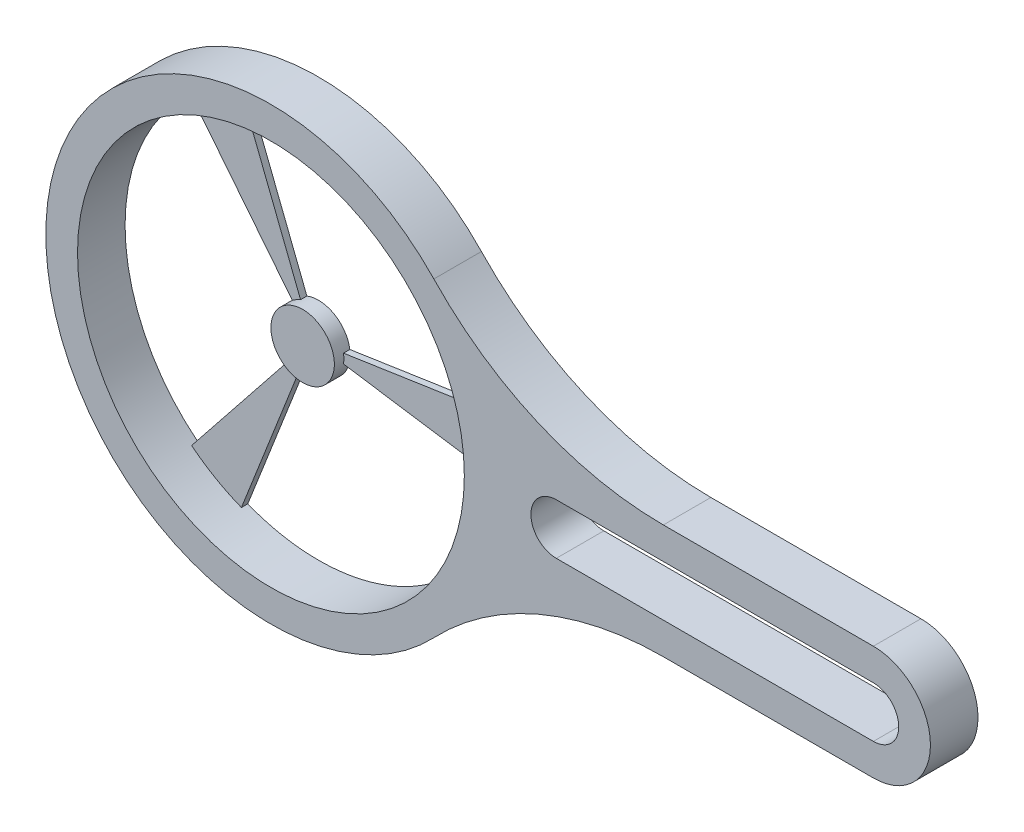
ISO-10303-21;
HEADER;
FILE_DESCRIPTION(('STEP AP214'),'2;1');
FILE_NAME('part.step','',(''),(''),'','','');
FILE_SCHEMA(('AUTOMOTIVE_DESIGN { 1 0 10303 214 1 1 1 1 }'));
ENDSEC;
DATA;
#1=APPLICATION_CONTEXT('core data for automotive mechanical design processes');
#2=APPLICATION_PROTOCOL_DEFINITION('international standard','automotive_design',2000,#1);
#3=PRODUCT_CONTEXT('',#1,'mechanical');
#4=PRODUCT('Part','Part','',(#3));
#5=PRODUCT_RELATED_PRODUCT_CATEGORY('part','',(#4));
#6=PRODUCT_DEFINITION_FORMATION('','',#4);
#7=PRODUCT_DEFINITION_CONTEXT('part definition',#1,'design');
#8=PRODUCT_DEFINITION('design','',#6,#7);
#9=PRODUCT_DEFINITION_SHAPE('','',#8);
#10=(LENGTH_UNIT() NAMED_UNIT(*) SI_UNIT(.MILLI.,.METRE.));
#11=(NAMED_UNIT(*) PLANE_ANGLE_UNIT() SI_UNIT($,.RADIAN.));
#12=(NAMED_UNIT(*) SI_UNIT($,.STERADIAN.) SOLID_ANGLE_UNIT());
#13=UNCERTAINTY_MEASURE_WITH_UNIT(LENGTH_MEASURE(1.E-05),#10,'distance_accuracy_value','');
#14=(GEOMETRIC_REPRESENTATION_CONTEXT(3) GLOBAL_UNCERTAINTY_ASSIGNED_CONTEXT((#13)) GLOBAL_UNIT_ASSIGNED_CONTEXT((#10,
#11,#12)) REPRESENTATION_CONTEXT('',''));
#15=CARTESIAN_POINT('',(0.,0.,0.));
#16=DIRECTION('',(0.,0.,1.));
#17=DIRECTION('',(1.,0.,0.));
#18=AXIS2_PLACEMENT_3D('',#15,#16,#17);
#19=CARTESIAN_POINT('',(0.,0.,15.));
#20=DIRECTION('',(0.,0.,-1.));
#21=DIRECTION('',(-1.,0.,0.));
#22=AXIS2_PLACEMENT_3D('',#19,#20,#21);
#23=CYLINDRICAL_SURFACE('',#22,61.);
#24=CARTESIAN_POINT('',(0.,0.,15.));
#25=DIRECTION('',(0.,0.,1.));
#26=DIRECTION('',(1.,0.,0.));
#27=AXIS2_PLACEMENT_3D('',#24,#25,#26);
#28=CIRCLE('',#27,61.);
#29=CARTESIAN_POINT('',(61.,0.,15.));
#30=VERTEX_POINT('',#29);
#31=EDGE_CURVE('E340',#30,#30,#28,.T.);
#32=ORIENTED_EDGE('',*,*,#31,.T.);
#33=EDGE_LOOP('',(#32));
#34=FACE_BOUND('',#33,.T.);
#35=CARTESIAN_POINT('',(0.,0.,2.));
#36=DIRECTION('',(0.,0.,-1.));
#37=DIRECTION('',(-1.,0.,0.));
#38=AXIS2_PLACEMENT_3D('',#35,#36,#37);
#39=CIRCLE('',#38,61.);
#40=CARTESIAN_POINT('',(-30.5007499967145,-52.8271166129472,2.));
#41=VERTEX_POINT('',#40);
#42=CARTESIAN_POINT('',(-38.0202984913741,-47.7017494713435,2.));
#43=VERTEX_POINT('',#42);
#44=EDGE_CURVE('E224',#41,#43,#39,.T.);
#45=ORIENTED_EDGE('',*,*,#44,.T.);
#46=DIRECTION('',(0.,0.,-1.));
#47=VECTOR('',#46,1.);
#48=CARTESIAN_POINT('',(-38.0202984913741,-47.7017494713435,2.));
#49=LINE('',#48,#47);
#50=CARTESIAN_POINT('',(-38.0202984913741,-47.7017494713435,0.));
#51=VERTEX_POINT('',#50);
#52=EDGE_CURVE('E243',#43,#51,#49,.T.);
#53=ORIENTED_EDGE('',*,*,#52,.T.);
#54=CARTESIAN_POINT('',(0.,0.,0.));
#55=DIRECTION('',(0.,0.,1.));
#56=DIRECTION('',(1.,0.,0.));
#57=AXIS2_PLACEMENT_3D('',#54,#55,#56);
#58=CIRCLE('',#57,61.);
#59=CARTESIAN_POINT('',(-38.0202984913748,47.7017494713429,0.));
#60=VERTEX_POINT('',#59);
#61=EDGE_CURVE('E371',#60,#51,#58,.T.);
#62=ORIENTED_EDGE('',*,*,#61,.F.);
#63=DIRECTION('',(0.,0.,-1.));
#64=VECTOR('',#63,1.);
#65=CARTESIAN_POINT('',(-38.0202984913748,47.7017494713429,2.));
#66=LINE('',#65,#64);
#67=CARTESIAN_POINT('',(-38.0202984913748,47.7017494713429,2.));
#68=VERTEX_POINT('',#67);
#69=EDGE_CURVE('E314',#68,#60,#66,.T.);
#70=ORIENTED_EDGE('',*,*,#69,.F.);
#71=CARTESIAN_POINT('',(0.,0.,2.));
#72=DIRECTION('',(0.,0.,-1.));
#73=DIRECTION('',(-1.,0.,0.));
#74=AXIS2_PLACEMENT_3D('',#71,#72,#73);
#75=CIRCLE('',#74,61.);
#76=CARTESIAN_POINT('',(-30.5007499969265,52.8271166128248,2.));
#77=VERTEX_POINT('',#76);
#78=EDGE_CURVE('E292',#68,#77,#75,.T.);
#79=ORIENTED_EDGE('',*,*,#78,.T.);
#80=DIRECTION('',(0.,0.,-1.));
#81=VECTOR('',#80,1.);
#82=CARTESIAN_POINT('',(-30.5007499969265,52.8271166128248,2.));
#83=LINE('',#82,#81);
#84=CARTESIAN_POINT('',(-30.5007499969265,52.8271166128248,0.));
#85=VERTEX_POINT('',#84);
#86=EDGE_CURVE('E307',#77,#85,#83,.T.);
#87=ORIENTED_EDGE('',*,*,#86,.T.);
#88=CARTESIAN_POINT('',(-30.5007499967145,-52.8271166129472,0.));
#89=VERTEX_POINT('',#88);
#90=EDGE_CURVE('E370',#89,#85,#58,.T.);
#91=ORIENTED_EDGE('',*,*,#90,.F.);
#92=DIRECTION('',(0.,0.,-1.));
#93=VECTOR('',#92,1.);
#94=CARTESIAN_POINT('',(-30.5007499967145,-52.8271166129472,2.));
#95=LINE('',#94,#93);
#96=EDGE_CURVE('E215',#41,#89,#95,.T.);
#97=ORIENTED_EDGE('',*,*,#96,.F.);
#98=EDGE_LOOP('',(#45,#53,#62,#70,#79,#87,#91,#97));
#99=FACE_BOUND('',#98,.T.);
#100=ADVANCED_FACE('F39',(#34,#99),#23,.F.);
#101=CARTESIAN_POINT('',(0.,0.,5.));
#102=DIRECTION('',(0.,0.,-1.));
#103=DIRECTION('',(-1.,0.,0.));
#104=AXIS2_PLACEMENT_3D('',#101,#102,#103);
#105=CYLINDRICAL_SURFACE('',#104,10.);
#106=DIRECTION('',(0.,0.,-1.));
#107=VECTOR('',#106,1.);
#108=CARTESIAN_POINT('',(-3.65696659329943,-9.30734093796354,2.));
#109=LINE('',#108,#107);
#110=CARTESIAN_POINT('',(-3.65696659329943,-9.30734093796354,2.));
#111=VERTEX_POINT('',#110);
#112=CARTESIAN_POINT('',(-3.65696659329943,-9.30734093796354,0.));
#113=VERTEX_POINT('',#112);
#114=EDGE_CURVE('E228',#111,#113,#109,.T.);
#115=ORIENTED_EDGE('',*,*,#114,.T.);
#116=CARTESIAN_POINT('',(0.,0.,0.));
#117=DIRECTION('',(0.,0.,-1.));
#118=DIRECTION('',(-1.,0.,0.));
#119=AXIS2_PLACEMENT_3D('',#116,#117,#118);
#120=CIRCLE('',#119,10.);
#121=CARTESIAN_POINT('',(9.88871644305629,-1.48771203827495,0.));
#122=VERTEX_POINT('',#121);
#123=EDGE_CURVE('E291',#122,#113,#120,.T.);
#124=ORIENTED_EDGE('',*,*,#123,.F.);
#125=DIRECTION('',(0.,0.,-1.));
#126=VECTOR('',#125,1.);
#127=CARTESIAN_POINT('',(9.88871644305629,-1.48771203827495,2.));
#128=LINE('',#127,#126);
#129=CARTESIAN_POINT('',(9.88871644305629,-1.48771203827495,2.));
#130=VERTEX_POINT('',#129);
#131=EDGE_CURVE('E273',#130,#122,#128,.T.);
#132=ORIENTED_EDGE('',*,*,#131,.F.);
#133=CARTESIAN_POINT('',(0.,0.,2.));
#134=DIRECTION('',(0.,0.,-1.));
#135=DIRECTION('',(-1.,0.,0.));
#136=AXIS2_PLACEMENT_3D('',#133,#134,#135);
#137=CIRCLE('',#136,10.);
#138=CARTESIAN_POINT('',(9.88871644305629,1.48771203827495,2.));
#139=VERTEX_POINT('',#138);
#140=EDGE_CURVE('E247',#139,#130,#137,.T.);
#141=ORIENTED_EDGE('',*,*,#140,.F.);
#142=DIRECTION('',(0.,0.,-1.));
#143=VECTOR('',#142,1.);
#144=CARTESIAN_POINT('',(9.88871644305629,1.48771203827495,2.));
#145=LINE('',#144,#143);
#146=CARTESIAN_POINT('',(9.88871644305629,1.48771203827495,0.));
#147=VERTEX_POINT('',#146);
#148=EDGE_CURVE('E262',#139,#147,#145,.T.);
#149=ORIENTED_EDGE('',*,*,#148,.T.);
#150=CARTESIAN_POINT('',(-3.65696659329956,9.30734093796349,0.));
#151=VERTEX_POINT('',#150);
#152=EDGE_CURVE('E288',#151,#147,#120,.T.);
#153=ORIENTED_EDGE('',*,*,#152,.F.);
#154=DIRECTION('',(0.,0.,-1.));
#155=VECTOR('',#154,1.);
#156=CARTESIAN_POINT('',(-3.65696659329956,9.30734093796349,2.));
#157=LINE('',#156,#155);
#158=CARTESIAN_POINT('',(-3.65696659329956,9.30734093796349,2.));
#159=VERTEX_POINT('',#158);
#160=EDGE_CURVE('E321',#159,#151,#157,.T.);
#161=ORIENTED_EDGE('',*,*,#160,.F.);
#162=CARTESIAN_POINT('',(0.,0.,2.));
#163=DIRECTION('',(0.,0.,-1.));
#164=DIRECTION('',(-1.,0.,0.));
#165=AXIS2_PLACEMENT_3D('',#162,#163,#164);
#166=CIRCLE('',#165,10.);
#167=CARTESIAN_POINT('',(-6.23324981595711,7.81962893824705,2.));
#168=VERTEX_POINT('',#167);
#169=EDGE_CURVE('E301',#168,#159,#166,.T.);
#170=ORIENTED_EDGE('',*,*,#169,.F.);
#171=DIRECTION('',(0.,0.,-1.));
#172=VECTOR('',#171,1.);
#173=CARTESIAN_POINT('',(-6.23324981595711,7.81962893824705,2.));
#174=LINE('',#173,#172);
#175=CARTESIAN_POINT('',(-6.23324981595711,7.81962893824705,0.));
#176=VERTEX_POINT('',#175);
#177=EDGE_CURVE('E318',#168,#176,#174,.T.);
#178=ORIENTED_EDGE('',*,*,#177,.T.);
#179=CARTESIAN_POINT('',(-6.233249815957,-7.81962893824714,0.));
#180=VERTEX_POINT('',#179);
#181=EDGE_CURVE('E275',#180,#176,#120,.T.);
#182=ORIENTED_EDGE('',*,*,#181,.F.);
#183=DIRECTION('',(0.,0.,-1.));
#184=VECTOR('',#183,1.);
#185=CARTESIAN_POINT('',(-6.233249815957,-7.81962893824714,2.));
#186=LINE('',#185,#184);
#187=CARTESIAN_POINT('',(-6.233249815957,-7.81962893824714,2.));
#188=VERTEX_POINT('',#187);
#189=EDGE_CURVE('E241',#188,#180,#186,.T.);
#190=ORIENTED_EDGE('',*,*,#189,.F.);
#191=CARTESIAN_POINT('',(0.,0.,2.));
#192=DIRECTION('',(0.,0.,-1.));
#193=DIRECTION('',(-1.,0.,0.));
#194=AXIS2_PLACEMENT_3D('',#191,#192,#193);
#195=CIRCLE('',#194,10.);
#196=EDGE_CURVE('E216',#111,#188,#195,.T.);
#197=ORIENTED_EDGE('',*,*,#196,.F.);
#198=EDGE_LOOP('',(#115,#124,#132,#141,#149,#153,#161,#170,#178,#182,#190,#197));
#199=FACE_BOUND('',#198,.T.);
#200=CARTESIAN_POINT('',(0.,0.,5.));
#201=DIRECTION('',(0.,0.,-1.));
#202=DIRECTION('',(-1.,0.,0.));
#203=AXIS2_PLACEMENT_3D('',#200,#201,#202);
#204=CIRCLE('',#203,10.);
#205=CARTESIAN_POINT('',(-10.,0.,5.));
#206=VERTEX_POINT('',#205);
#207=EDGE_CURVE('E284',#206,#206,#204,.T.);
#208=ORIENTED_EDGE('',*,*,#207,.T.);
#209=EDGE_LOOP('',(#208));
#210=FACE_BOUND('',#209,.T.);
#211=ADVANCED_FACE('F463',(#199,#210),#105,.T.);
#212=CARTESIAN_POINT('',(0.,18.,15.));
#213=DIRECTION('',(0.,-1.,0.));
#214=DIRECTION('',(0.,0.,-1.));
#215=AXIS2_PLACEMENT_3D('',#212,#213,#214);
#216=PLANE('',#215);
#217=DIRECTION('',(-1.,0.,0.));
#218=VECTOR('',#217,1.);
#219=CARTESIAN_POINT('',(0.,18.,0.));
#220=LINE('',#219,#218);
#221=CARTESIAN_POINT('',(190.,18.,0.));
#222=VERTEX_POINT('',#221);
#223=CARTESIAN_POINT('',(123.761868117769,18.,0.));
#224=VERTEX_POINT('',#223);
#225=EDGE_CURVE('E373',#222,#224,#220,.T.);
#226=ORIENTED_EDGE('',*,*,#225,.T.);
#227=DIRECTION('',(0.,0.,-1.));
#228=VECTOR('',#227,1.);
#229=CARTESIAN_POINT('',(123.761868117769,18.,15.));
#230=LINE('',#229,#228);
#231=CARTESIAN_POINT('',(123.761868117769,18.,15.));
#232=VERTEX_POINT('',#231);
#233=EDGE_CURVE('E11',#232,#224,#230,.T.);
#234=ORIENTED_EDGE('',*,*,#233,.F.);
#235=DIRECTION('',(-1.,0.,0.));
#236=VECTOR('',#235,1.);
#237=CARTESIAN_POINT('',(0.,18.,15.));
#238=LINE('',#237,#236);
#239=CARTESIAN_POINT('',(190.,18.,15.));
#240=VERTEX_POINT('',#239);
#241=EDGE_CURVE('E343',#240,#232,#238,.T.);
#242=ORIENTED_EDGE('',*,*,#241,.F.);
#243=DIRECTION('',(0.,0.,-1.));
#244=VECTOR('',#243,1.);
#245=CARTESIAN_POINT('',(190.,18.,15.));
#246=LINE('',#245,#244);
#247=EDGE_CURVE('E388',#240,#222,#246,.T.);
#248=ORIENTED_EDGE('',*,*,#247,.T.);
#249=EDGE_LOOP('',(#226,#234,#242,#248));
#250=FACE_BOUND('',#249,.T.);
#251=ADVANCED_FACE('F435',(#250),#216,.F.);
#252=CARTESIAN_POINT('',(123.761868117769,118.,15.));
#253=DIRECTION('',(0.,0.,-1.));
#254=DIRECTION('',(-1.,0.,0.));
#255=AXIS2_PLACEMENT_3D('',#252,#253,#254);
#256=CYLINDRICAL_SURFACE('',#255,100.);
#257=CARTESIAN_POINT('',(123.761868117769,118.,0.));
#258=DIRECTION('',(0.,0.,1.));
#259=DIRECTION('',(1.,0.,0.));
#260=AXIS2_PLACEMENT_3D('',#257,#258,#259);
#261=CIRCLE('',#260,100.);
#262=CARTESIAN_POINT('',(51.3865066453894,48.9941520467836,0.));
#263=VERTEX_POINT('',#262);
#264=EDGE_CURVE('E376',#224,#263,#261,.F.);
#265=ORIENTED_EDGE('',*,*,#264,.T.);
#266=DIRECTION('',(0.,0.,-1.));
#267=VECTOR('',#266,1.);
#268=CARTESIAN_POINT('',(51.3865066453894,48.9941520467836,15.));
#269=LINE('',#268,#267);
#270=CARTESIAN_POINT('',(51.3865066453894,48.9941520467836,15.));
#271=VERTEX_POINT('',#270);
#272=EDGE_CURVE('E48',#271,#263,#269,.T.);
#273=ORIENTED_EDGE('',*,*,#272,.F.);
#274=CARTESIAN_POINT('',(123.761868117769,118.,15.));
#275=DIRECTION('',(0.,0.,1.));
#276=DIRECTION('',(1.,0.,0.));
#277=AXIS2_PLACEMENT_3D('',#274,#275,#276);
#278=CIRCLE('',#277,100.);
#279=EDGE_CURVE('E346',#232,#271,#278,.F.);
#280=ORIENTED_EDGE('',*,*,#279,.F.);
#281=ORIENTED_EDGE('',*,*,#233,.T.);
#282=EDGE_LOOP('',(#265,#273,#280,#281));
#283=FACE_BOUND('',#282,.T.);
#284=ADVANCED_FACE('F438',(#283),#256,.F.);
#285=CARTESIAN_POINT('',(0.,0.,15.));
#286=DIRECTION('',(0.,0.,-1.));
#287=DIRECTION('',(-1.,0.,0.));
#288=AXIS2_PLACEMENT_3D('',#285,#286,#287);
#289=CYLINDRICAL_SURFACE('',#288,71.);
#290=CARTESIAN_POINT('',(0.,0.,0.));
#291=DIRECTION('',(0.,0.,1.));
#292=DIRECTION('',(1.,0.,0.));
#293=AXIS2_PLACEMENT_3D('',#290,#291,#292);
#294=CIRCLE('',#293,71.);
#295=CARTESIAN_POINT('',(51.3865066453894,-48.9941520467836,0.));
#296=VERTEX_POINT('',#295);
#297=EDGE_CURVE('E378',#263,#296,#294,.T.);
#298=ORIENTED_EDGE('',*,*,#297,.T.);
#299=DIRECTION('',(0.,0.,-1.));
#300=VECTOR('',#299,1.);
#301=CARTESIAN_POINT('',(51.3865066453894,-48.9941520467836,15.));
#302=LINE('',#301,#300);
#303=CARTESIAN_POINT('',(51.3865066453894,-48.9941520467836,15.));
#304=VERTEX_POINT('',#303);
#305=EDGE_CURVE('E395',#304,#296,#302,.T.);
#306=ORIENTED_EDGE('',*,*,#305,.F.);
#307=CARTESIAN_POINT('',(0.,0.,15.));
#308=DIRECTION('',(0.,0.,1.));
#309=DIRECTION('',(1.,0.,0.));
#310=AXIS2_PLACEMENT_3D('',#307,#308,#309);
#311=CIRCLE('',#310,71.);
#312=EDGE_CURVE('E348',#271,#304,#311,.T.);
#313=ORIENTED_EDGE('',*,*,#312,.F.);
#314=ORIENTED_EDGE('',*,*,#272,.T.);
#315=EDGE_LOOP('',(#298,#306,#313,#314));
#316=FACE_BOUND('',#315,.T.);
#317=ADVANCED_FACE('F443',(#316),#289,.T.);
#318=CARTESIAN_POINT('',(123.761868117769,-118.,15.));
#319=DIRECTION('',(0.,0.,-1.));
#320=DIRECTION('',(-1.,0.,0.));
#321=AXIS2_PLACEMENT_3D('',#318,#319,#320);
#322=CYLINDRICAL_SURFACE('',#321,100.);
#323=CARTESIAN_POINT('',(123.761868117769,-118.,0.));
#324=DIRECTION('',(0.,0.,1.));
#325=DIRECTION('',(1.,0.,0.));
#326=AXIS2_PLACEMENT_3D('',#323,#324,#325);
#327=CIRCLE('',#326,100.);
#328=CARTESIAN_POINT('',(123.761868117769,-18.,0.));
#329=VERTEX_POINT('',#328);
#330=EDGE_CURVE('E381',#329,#296,#327,.T.);
#331=ORIENTED_EDGE('',*,*,#330,.F.);
#332=DIRECTION('',(0.,0.,-1.));
#333=VECTOR('',#332,1.);
#334=CARTESIAN_POINT('',(123.761868117769,-18.,15.));
#335=LINE('',#334,#333);
#336=CARTESIAN_POINT('',(123.761868117769,-18.,15.));
#337=VERTEX_POINT('',#336);
#338=EDGE_CURVE('E393',#337,#329,#335,.T.);
#339=ORIENTED_EDGE('',*,*,#338,.F.);
#340=CARTESIAN_POINT('',(123.761868117769,-118.,15.));
#341=DIRECTION('',(0.,0.,1.));
#342=DIRECTION('',(1.,0.,0.));
#343=AXIS2_PLACEMENT_3D('',#340,#341,#342);
#344=CIRCLE('',#343,100.);
#345=EDGE_CURVE('E350',#337,#304,#344,.T.);
#346=ORIENTED_EDGE('',*,*,#345,.T.);
#347=ORIENTED_EDGE('',*,*,#305,.T.);
#348=EDGE_LOOP('',(#331,#339,#346,#347));
#349=FACE_BOUND('',#348,.T.);
#350=ADVANCED_FACE('F453',(#349),#322,.F.);
#351=CARTESIAN_POINT('',(0.,-18.,15.));
#352=DIRECTION('',(0.,-1.,0.));
#353=DIRECTION('',(0.,0.,-1.));
#354=AXIS2_PLACEMENT_3D('',#351,#352,#353);
#355=PLANE('',#354);
#356=DIRECTION('',(-1.,0.,0.));
#357=VECTOR('',#356,1.);
#358=CARTESIAN_POINT('',(0.,-18.,0.));
#359=LINE('',#358,#357);
#360=CARTESIAN_POINT('',(190.,-18.,0.));
#361=VERTEX_POINT('',#360);
#362=EDGE_CURVE('E384',#361,#329,#359,.T.);
#363=ORIENTED_EDGE('',*,*,#362,.F.);
#364=DIRECTION('',(0.,0.,-1.));
#365=VECTOR('',#364,1.);
#366=CARTESIAN_POINT('',(190.,-18.,15.));
#367=LINE('',#366,#365);
#368=CARTESIAN_POINT('',(190.,-18.,15.));
#369=VERTEX_POINT('',#368);
#370=EDGE_CURVE('E391',#369,#361,#367,.T.);
#371=ORIENTED_EDGE('',*,*,#370,.F.);
#372=DIRECTION('',(-1.,0.,0.));
#373=VECTOR('',#372,1.);
#374=CARTESIAN_POINT('',(0.,-18.,15.));
#375=LINE('',#374,#373);
#376=EDGE_CURVE('E353',#369,#337,#375,.T.);
#377=ORIENTED_EDGE('',*,*,#376,.T.);
#378=ORIENTED_EDGE('',*,*,#338,.T.);
#379=EDGE_LOOP('',(#363,#371,#377,#378));
#380=FACE_BOUND('',#379,.T.);
#381=ADVANCED_FACE('F448',(#380),#355,.T.);
#382=CARTESIAN_POINT('',(0.,-8.00000000000001,15.));
#383=DIRECTION('',(0.,1.,0.));
#384=DIRECTION('',(0.,0.,1.));
#385=AXIS2_PLACEMENT_3D('',#382,#383,#384);
#386=PLANE('',#385);
#387=DIRECTION('',(1.,0.,0.));
#388=VECTOR('',#387,1.);
#389=CARTESIAN_POINT('',(0.,-8.00000000000001,0.));
#390=LINE('',#389,#388);
#391=CARTESIAN_POINT('',(90.,-8.00000000000001,0.));
#392=VERTEX_POINT('',#391);
#393=CARTESIAN_POINT('',(190.,-8.00000000000001,0.));
#394=VERTEX_POINT('',#393);
#395=EDGE_CURVE('E317',#392,#394,#390,.T.);
#396=ORIENTED_EDGE('',*,*,#395,.F.);
#397=DIRECTION('',(0.,0.,-1.));
#398=VECTOR('',#397,1.);
#399=CARTESIAN_POINT('',(90.,-8.00000000000001,15.));
#400=LINE('',#399,#398);
#401=CARTESIAN_POINT('',(90.,-8.00000000000001,15.));
#402=VERTEX_POINT('',#401);
#403=EDGE_CURVE('E43',#402,#392,#400,.T.);
#404=ORIENTED_EDGE('',*,*,#403,.F.);
#405=DIRECTION('',(1.,0.,0.));
#406=VECTOR('',#405,1.);
#407=CARTESIAN_POINT('',(0.,-8.00000000000001,15.));
#408=LINE('',#407,#406);
#409=CARTESIAN_POINT('',(190.,-8.00000000000001,15.));
#410=VERTEX_POINT('',#409);
#411=EDGE_CURVE('E328',#402,#410,#408,.T.);
#412=ORIENTED_EDGE('',*,*,#411,.T.);
#413=DIRECTION('',(0.,0.,-1.));
#414=VECTOR('',#413,1.);
#415=CARTESIAN_POINT('',(190.,-8.00000000000001,15.));
#416=LINE('',#415,#414);
#417=EDGE_CURVE('E358',#410,#394,#416,.T.);
#418=ORIENTED_EDGE('',*,*,#417,.T.);
#419=EDGE_LOOP('',(#396,#404,#412,#418));
#420=FACE_BOUND('',#419,.T.);
#421=ADVANCED_FACE('F41',(#420),#386,.T.);
#422=CARTESIAN_POINT('',(90.,0.,15.));
#423=DIRECTION('',(0.,0.,-1.));
#424=DIRECTION('',(-1.,0.,0.));
#425=AXIS2_PLACEMENT_3D('',#422,#423,#424);
#426=CYLINDRICAL_SURFACE('',#425,8.00000000000001);
#427=CARTESIAN_POINT('',(90.,0.,0.));
#428=DIRECTION('',(0.,0.,1.));
#429=DIRECTION('',(1.,0.,0.));
#430=AXIS2_PLACEMENT_3D('',#427,#428,#429);
#431=CIRCLE('',#430,8.00000000000001);
#432=CARTESIAN_POINT('',(90.,8.00000000000001,0.));
#433=VERTEX_POINT('',#432);
#434=EDGE_CURVE('E361',#433,#392,#431,.T.);
#435=ORIENTED_EDGE('',*,*,#434,.F.);
#436=DIRECTION('',(0.,0.,-1.));
#437=VECTOR('',#436,1.);
#438=CARTESIAN_POINT('',(90.,8.00000000000001,15.));
#439=LINE('',#438,#437);
#440=CARTESIAN_POINT('',(90.,8.00000000000001,15.));
#441=VERTEX_POINT('',#440);
#442=EDGE_CURVE('E401',#441,#433,#439,.T.);
#443=ORIENTED_EDGE('',*,*,#442,.F.);
#444=CARTESIAN_POINT('',(90.,0.,15.));
#445=DIRECTION('',(0.,0.,1.));
#446=DIRECTION('',(1.,0.,0.));
#447=AXIS2_PLACEMENT_3D('',#444,#445,#446);
#448=CIRCLE('',#447,8.00000000000001);
#449=EDGE_CURVE('E331',#441,#402,#448,.T.);
#450=ORIENTED_EDGE('',*,*,#449,.T.);
#451=ORIENTED_EDGE('',*,*,#403,.T.);
#452=EDGE_LOOP('',(#435,#443,#450,#451));
#453=FACE_BOUND('',#452,.T.);
#454=ADVANCED_FACE('F408',(#453),#426,.F.);
#455=CARTESIAN_POINT('',(0.,8.,15.));
#456=DIRECTION('',(0.,1.,0.));
#457=DIRECTION('',(-1.,0.,0.));
#458=AXIS2_PLACEMENT_3D('',#455,#456,#457);
#459=PLANE('',#458);
#460=DIRECTION('',(1.,0.,0.));
#461=VECTOR('',#460,1.);
#462=CARTESIAN_POINT('',(0.,8.,0.));
#463=LINE('',#462,#461);
#464=CARTESIAN_POINT('',(190.,8.00000000000001,0.));
#465=VERTEX_POINT('',#464);
#466=EDGE_CURVE('E364',#433,#465,#463,.T.);
#467=ORIENTED_EDGE('',*,*,#466,.T.);
#468=DIRECTION('',(0.,0.,-1.));
#469=VECTOR('',#468,1.);
#470=CARTESIAN_POINT('',(190.,8.00000000000001,15.));
#471=LINE('',#470,#469);
#472=CARTESIAN_POINT('',(190.,8.00000000000001,15.));
#473=VERTEX_POINT('',#472);
#474=EDGE_CURVE('E400',#473,#465,#471,.T.);
#475=ORIENTED_EDGE('',*,*,#474,.F.);
#476=DIRECTION('',(1.,0.,0.));
#477=VECTOR('',#476,1.);
#478=CARTESIAN_POINT('',(0.,8.,15.));
#479=LINE('',#478,#477);
#480=EDGE_CURVE('E335',#441,#473,#479,.T.);
#481=ORIENTED_EDGE('',*,*,#480,.F.);
#482=ORIENTED_EDGE('',*,*,#442,.T.);
#483=EDGE_LOOP('',(#467,#475,#481,#482));
#484=FACE_BOUND('',#483,.T.);
#485=ADVANCED_FACE('F416',(#484),#459,.F.);
#486=CARTESIAN_POINT('',(190.,0.,15.));
#487=DIRECTION('',(0.,0.,-1.));
#488=DIRECTION('',(-1.,0.,0.));
#489=AXIS2_PLACEMENT_3D('',#486,#487,#488);
#490=CYLINDRICAL_SURFACE('',#489,8.00000000000001);
#491=CARTESIAN_POINT('',(190.,0.,0.));
#492=DIRECTION('',(0.,0.,1.));
#493=DIRECTION('',(1.,0.,0.));
#494=AXIS2_PLACEMENT_3D('',#491,#492,#493);
#495=CIRCLE('',#494,8.00000000000001);
#496=EDGE_CURVE('E367',#394,#465,#495,.T.);
#497=ORIENTED_EDGE('',*,*,#496,.F.);
#498=ORIENTED_EDGE('',*,*,#417,.F.);
#499=CARTESIAN_POINT('',(190.,0.,15.));
#500=DIRECTION('',(0.,0.,1.));
#501=DIRECTION('',(1.,0.,0.));
#502=AXIS2_PLACEMENT_3D('',#499,#500,#501);
#503=CIRCLE('',#502,8.00000000000001);
#504=EDGE_CURVE('E337',#410,#473,#503,.T.);
#505=ORIENTED_EDGE('',*,*,#504,.T.);
#506=ORIENTED_EDGE('',*,*,#474,.T.);
#507=EDGE_LOOP('',(#497,#498,#505,#506));
#508=FACE_BOUND('',#507,.T.);
#509=ADVANCED_FACE('F419',(#508),#490,.F.);
#510=CARTESIAN_POINT('',(190.,0.,15.));
#511=DIRECTION('',(0.,0.,-1.));
#512=DIRECTION('',(-1.,0.,0.));
#513=AXIS2_PLACEMENT_3D('',#510,#511,#512);
#514=CYLINDRICAL_SURFACE('',#513,18.);
#515=CARTESIAN_POINT('',(190.,0.,0.));
#516=DIRECTION('',(0.,0.,1.));
#517=DIRECTION('',(1.,0.,0.));
#518=AXIS2_PLACEMENT_3D('',#515,#516,#517);
#519=CIRCLE('',#518,18.);
#520=EDGE_CURVE('E332',#361,#222,#519,.T.);
#521=ORIENTED_EDGE('',*,*,#520,.T.);
#522=ORIENTED_EDGE('',*,*,#247,.F.);
#523=CARTESIAN_POINT('',(190.,0.,15.));
#524=DIRECTION('',(0.,0.,1.));
#525=DIRECTION('',(1.,0.,0.));
#526=AXIS2_PLACEMENT_3D('',#523,#524,#525);
#527=CIRCLE('',#526,18.);
#528=EDGE_CURVE('E356',#369,#240,#527,.T.);
#529=ORIENTED_EDGE('',*,*,#528,.F.);
#530=ORIENTED_EDGE('',*,*,#370,.T.);
#531=EDGE_LOOP('',(#521,#522,#529,#530));
#532=FACE_BOUND('',#531,.T.);
#533=ADVANCED_FACE('F424',(#532),#514,.T.);
#534=CARTESIAN_POINT('',(0.,0.,15.));
#535=DIRECTION('',(0.,0.,1.));
#536=DIRECTION('',(1.,0.,0.));
#537=AXIS2_PLACEMENT_3D('',#534,#535,#536);
#538=PLANE('',#537);
#539=ORIENTED_EDGE('',*,*,#411,.F.);
#540=ORIENTED_EDGE('',*,*,#449,.F.);
#541=ORIENTED_EDGE('',*,*,#480,.T.);
#542=ORIENTED_EDGE('',*,*,#504,.F.);
#543=EDGE_LOOP('',(#539,#540,#541,#542));
#544=FACE_BOUND('',#543,.T.);
#545=ORIENTED_EDGE('',*,*,#31,.F.);
#546=EDGE_LOOP('',(#545));
#547=FACE_BOUND('',#546,.T.);
#548=ORIENTED_EDGE('',*,*,#241,.T.);
#549=ORIENTED_EDGE('',*,*,#279,.T.);
#550=ORIENTED_EDGE('',*,*,#312,.T.);
#551=ORIENTED_EDGE('',*,*,#345,.F.);
#552=ORIENTED_EDGE('',*,*,#376,.F.);
#553=ORIENTED_EDGE('',*,*,#528,.T.);
#554=EDGE_LOOP('',(#548,#549,#550,#551,#552,#553));
#555=FACE_BOUND('',#554,.T.);
#556=ADVANCED_FACE('F421',(#544,#547,#555),#538,.T.);
#557=CARTESIAN_POINT('',(0.,0.,0.));
#558=DIRECTION('',(0.,0.,1.));
#559=DIRECTION('',(1.,0.,0.));
#560=AXIS2_PLACEMENT_3D('',#557,#558,#559);
#561=PLANE('',#560);
#562=DIRECTION('',(-0.623275464019011,-0.782002363137022,0.));
#563=VECTOR('',#562,1.);
#564=CARTESIAN_POINT('',(-0.000495188262992046,0.000394677444649941,0.));
#565=LINE('',#564,#563);
#566=EDGE_CURVE('E56',#180,#51,#565,.T.);
#567=ORIENTED_EDGE('',*,*,#566,.F.);
#568=ORIENTED_EDGE('',*,*,#181,.T.);
#569=DIRECTION('',(-0.623275464019022,0.782002363137013,0.));
#570=VECTOR('',#569,1.);
#571=CARTESIAN_POINT('',(-0.000495188262992034,-0.000394677444649943,0.));
#572=LINE('',#571,#570);
#573=EDGE_CURVE('E296',#176,#60,#572,.T.);
#574=ORIENTED_EDGE('',*,*,#573,.T.);
#575=ORIENTED_EDGE('',*,*,#61,.T.);
#576=EDGE_LOOP('',(#567,#568,#574,#575));
#577=FACE_BOUND('',#576,.T.);
#578=ORIENTED_EDGE('',*,*,#395,.T.);
#579=ORIENTED_EDGE('',*,*,#496,.T.);
#580=ORIENTED_EDGE('',*,*,#466,.F.);
#581=ORIENTED_EDGE('',*,*,#434,.T.);
#582=EDGE_LOOP('',(#578,#579,#580,#581));
#583=FACE_BOUND('',#582,.T.);
#584=ORIENTED_EDGE('',*,*,#123,.T.);
#585=DIRECTION('',(-0.365596180286602,-0.930773566964515,0.));
#586=VECTOR('',#585,1.);
#587=CARTESIAN_POINT('',(-0.00100481173700797,0.000394677444649934,0.));
#588=LINE('',#587,#586);
#589=CARTESIAN_POINT('',(-22.3022776014562,-56.7765530632655,0.));
#590=VERTEX_POINT('',#589);
#591=EDGE_CURVE('E236',#113,#590,#588,.T.);
#592=ORIENTED_EDGE('',*,*,#591,.T.);
#593=CARTESIAN_POINT('',(-0.0015,0.000866025403784437,0.));
#594=DIRECTION('',(0.,0.,-1.));
#595=DIRECTION('',(-1.,0.,0.));
#596=AXIS2_PLACEMENT_3D('',#593,#594,#595);
#597=CIRCLE('',#596,61.);
#598=EDGE_CURVE('E64',#590,#89,#597,.T.);
#599=ORIENTED_EDGE('',*,*,#598,.T.);
#600=ORIENTED_EDGE('',*,*,#90,.T.);
#601=CARTESIAN_POINT('',(-0.00149999999999999,-0.000866025403784443,0.));
#602=DIRECTION('',(0.,0.,-1.));
#603=DIRECTION('',(-1.,0.,0.));
#604=AXIS2_PLACEMENT_3D('',#601,#602,#603);
#605=CIRCLE('',#604,61.);
#606=CARTESIAN_POINT('',(-22.302277601457,56.7765530632652,0.));
#607=VERTEX_POINT('',#606);
#608=EDGE_CURVE('E287',#85,#607,#605,.T.);
#609=ORIENTED_EDGE('',*,*,#608,.T.);
#610=DIRECTION('',(-0.365596180286615,0.93077356696451,0.));
#611=VECTOR('',#610,1.);
#612=CARTESIAN_POINT('',(-0.00100481173700796,-0.000394677444649946,0.));
#613=LINE('',#612,#611);
#614=EDGE_CURVE('E310',#151,#607,#613,.T.);
#615=ORIENTED_EDGE('',*,*,#614,.F.);
#616=ORIENTED_EDGE('',*,*,#152,.T.);
#617=DIRECTION('',(0.988871644305629,0.148771203827495,0.));
#618=VECTOR('',#617,1.);
#619=CARTESIAN_POINT('',(0.,0.,0.));
#620=LINE('',#619,#618);
#621=CARTESIAN_POINT('',(60.3195760928313,9.07480359192219,0.));
#622=VERTEX_POINT('',#621);
#623=EDGE_CURVE('E240',#147,#622,#620,.T.);
#624=ORIENTED_EDGE('',*,*,#623,.T.);
#625=CARTESIAN_POINT('',(-0.00149999999999999,-0.000866025403784443,0.));
#626=DIRECTION('',(0.,0.,-1.));
#627=DIRECTION('',(-1.,0.,0.));
#628=AXIS2_PLACEMENT_3D('',#625,#626,#627);
#629=CIRCLE('',#628,61.);
#630=CARTESIAN_POINT('',(60.9984999938525,0.,0.));
#631=VERTEX_POINT('',#630);
#632=EDGE_CURVE('E265',#622,#631,#629,.T.);
#633=ORIENTED_EDGE('',*,*,#632,.T.);
#634=CARTESIAN_POINT('',(-0.0015,0.000866025403784437,0.));
#635=DIRECTION('',(0.,0.,-1.));
#636=DIRECTION('',(-1.,0.,0.));
#637=AXIS2_PLACEMENT_3D('',#634,#635,#636);
#638=CIRCLE('',#637,61.);
#639=CARTESIAN_POINT('',(60.3195760928313,-9.0748035919222,0.));
#640=VERTEX_POINT('',#639);
#641=EDGE_CURVE('E268',#631,#640,#638,.T.);
#642=ORIENTED_EDGE('',*,*,#641,.T.);
#643=DIRECTION('',(0.988871644305629,-0.148771203827495,0.));
#644=VECTOR('',#643,1.);
#645=CARTESIAN_POINT('',(0.,0.,0.));
#646=LINE('',#645,#644);
#647=EDGE_CURVE('E251',#122,#640,#646,.T.);
#648=ORIENTED_EDGE('',*,*,#647,.F.);
#649=EDGE_LOOP('',(#584,#592,#599,#600,#609,#615,#616,#624,#633,#642,#648));
#650=FACE_BOUND('',#649,.T.);
#651=ORIENTED_EDGE('',*,*,#225,.F.);
#652=ORIENTED_EDGE('',*,*,#520,.F.);
#653=ORIENTED_EDGE('',*,*,#362,.T.);
#654=ORIENTED_EDGE('',*,*,#330,.T.);
#655=ORIENTED_EDGE('',*,*,#297,.F.);
#656=ORIENTED_EDGE('',*,*,#264,.F.);
#657=EDGE_LOOP('',(#651,#652,#653,#654,#655,#656));
#658=FACE_BOUND('',#657,.T.);
#659=ADVANCED_FACE('F414',(#577,#583,#650,#658),#561,.F.);
#660=CARTESIAN_POINT('',(-0.000495188262992034,-0.000394677444649943,2.));
#661=DIRECTION('',(-0.782002363137013,-0.623275464019022,0.));
#662=DIRECTION('',(0.623275464019022,-0.782002363137013,0.));
#663=AXIS2_PLACEMENT_3D('',#660,#661,#662);
#664=PLANE('',#663);
#665=ORIENTED_EDGE('',*,*,#573,.F.);
#666=ORIENTED_EDGE('',*,*,#177,.F.);
#667=DIRECTION('',(-0.623275464019022,0.782002363137013,0.));
#668=VECTOR('',#667,1.);
#669=CARTESIAN_POINT('',(-0.000495188262992034,-0.000394677444649943,2.));
#670=LINE('',#669,#668);
#671=EDGE_CURVE('E304',#168,#68,#670,.T.);
#672=ORIENTED_EDGE('',*,*,#671,.T.);
#673=ORIENTED_EDGE('',*,*,#69,.T.);
#674=EDGE_LOOP('',(#665,#666,#672,#673));
#675=FACE_BOUND('',#674,.T.);
#676=ADVANCED_FACE('F543',(#675),#664,.T.);
#677=CARTESIAN_POINT('',(-0.00100481173700796,-0.000394677444649946,2.));
#678=DIRECTION('',(-0.93077356696451,-0.365596180286615,0.));
#679=DIRECTION('',(0.365596180286615,-0.93077356696451,0.));
#680=AXIS2_PLACEMENT_3D('',#677,#678,#679);
#681=PLANE('',#680);
#682=ORIENTED_EDGE('',*,*,#614,.T.);
#683=DIRECTION('',(0.,0.,-1.));
#684=VECTOR('',#683,1.);
#685=CARTESIAN_POINT('',(-22.302277601457,56.7765530632652,2.));
#686=LINE('',#685,#684);
#687=CARTESIAN_POINT('',(-22.302277601457,56.7765530632652,2.));
#688=VERTEX_POINT('',#687);
#689=EDGE_CURVE('E324',#688,#607,#686,.T.);
#690=ORIENTED_EDGE('',*,*,#689,.F.);
#691=DIRECTION('',(-0.365596180286615,0.93077356696451,0.));
#692=VECTOR('',#691,1.);
#693=CARTESIAN_POINT('',(-0.00100481173700796,-0.000394677444649946,2.));
#694=LINE('',#693,#692);
#695=EDGE_CURVE('E299',#159,#688,#694,.T.);
#696=ORIENTED_EDGE('',*,*,#695,.F.);
#697=ORIENTED_EDGE('',*,*,#160,.T.);
#698=EDGE_LOOP('',(#682,#690,#696,#697));
#699=FACE_BOUND('',#698,.T.);
#700=ADVANCED_FACE('F641',(#699),#681,.F.);
#701=CARTESIAN_POINT('',(-0.00149999999999999,-0.000866025403784443,2.));
#702=DIRECTION('',(0.,0.,-1.));
#703=DIRECTION('',(-1.,0.,0.));
#704=AXIS2_PLACEMENT_3D('',#701,#702,#703);
#705=CYLINDRICAL_SURFACE('',#704,61.);
#706=ORIENTED_EDGE('',*,*,#608,.F.);
#707=ORIENTED_EDGE('',*,*,#86,.F.);
#708=CARTESIAN_POINT('',(-0.00149999999999999,-0.000866025403784443,2.));
#709=DIRECTION('',(0.,0.,-1.));
#710=DIRECTION('',(-1.,0.,0.));
#711=AXIS2_PLACEMENT_3D('',#708,#709,#710);
#712=CIRCLE('',#711,61.);
#713=EDGE_CURVE('E295',#77,#688,#712,.T.);
#714=ORIENTED_EDGE('',*,*,#713,.T.);
#715=ORIENTED_EDGE('',*,*,#689,.T.);
#716=EDGE_LOOP('',(#706,#707,#714,#715));
#717=FACE_BOUND('',#716,.T.);
#718=ADVANCED_FACE('F637',(#717),#705,.T.);
#719=CARTESIAN_POINT('',(0.,0.,2.));
#720=DIRECTION('',(0.,0.,-1.));
#721=DIRECTION('',(-1.,0.,0.));
#722=AXIS2_PLACEMENT_3D('',#719,#720,#721);
#723=PLANE('',#722);
#724=ORIENTED_EDGE('',*,*,#78,.F.);
#725=ORIENTED_EDGE('',*,*,#671,.F.);
#726=ORIENTED_EDGE('',*,*,#169,.T.);
#727=ORIENTED_EDGE('',*,*,#695,.T.);
#728=ORIENTED_EDGE('',*,*,#713,.F.);
#729=EDGE_LOOP('',(#724,#725,#726,#727,#728));
#730=FACE_BOUND('',#729,.T.);
#731=ADVANCED_FACE('F561',(#730),#723,.F.);
#732=CARTESIAN_POINT('',(0.,0.,5.));
#733=DIRECTION('',(0.,0.,-1.));
#734=DIRECTION('',(-1.,0.,0.));
#735=AXIS2_PLACEMENT_3D('',#732,#733,#734);
#736=PLANE('',#735);
#737=ORIENTED_EDGE('',*,*,#207,.F.);
#738=EDGE_LOOP('',(#737));
#739=FACE_BOUND('',#738,.T.);
#740=ADVANCED_FACE('F556',(#739),#736,.F.);
#741=CARTESIAN_POINT('',(0.,0.,2.));
#742=DIRECTION('',(0.148771203827495,0.988871644305629,0.));
#743=DIRECTION('',(-0.988871644305629,0.148771203827495,0.));
#744=AXIS2_PLACEMENT_3D('',#741,#742,#743);
#745=PLANE('',#744);
#746=ORIENTED_EDGE('',*,*,#647,.T.);
#747=DIRECTION('',(0.,0.,-1.));
#748=VECTOR('',#747,1.);
#749=CARTESIAN_POINT('',(60.3195760928313,-9.0748035919222,2.));
#750=LINE('',#749,#748);
#751=CARTESIAN_POINT('',(60.3195760928313,-9.0748035919222,2.));
#752=VERTEX_POINT('',#751);
#753=EDGE_CURVE('E276',#752,#640,#750,.T.);
#754=ORIENTED_EDGE('',*,*,#753,.F.);
#755=DIRECTION('',(0.988871644305629,-0.148771203827495,0.));
#756=VECTOR('',#755,1.);
#757=CARTESIAN_POINT('',(0.,0.,2.));
#758=LINE('',#757,#756);
#759=EDGE_CURVE('E260',#130,#752,#758,.T.);
#760=ORIENTED_EDGE('',*,*,#759,.F.);
#761=ORIENTED_EDGE('',*,*,#131,.T.);
#762=EDGE_LOOP('',(#746,#754,#760,#761));
#763=FACE_BOUND('',#762,.T.);
#764=ADVANCED_FACE('F560',(#763),#745,.F.);
#765=CARTESIAN_POINT('',(-0.0015,0.000866025403784437,2.));
#766=DIRECTION('',(0.,0.,-1.));
#767=DIRECTION('',(-1.,0.,0.));
#768=AXIS2_PLACEMENT_3D('',#765,#766,#767);
#769=CYLINDRICAL_SURFACE('',#768,61.);
#770=ORIENTED_EDGE('',*,*,#641,.F.);
#771=DIRECTION('',(0.,0.,-1.));
#772=VECTOR('',#771,1.);
#773=CARTESIAN_POINT('',(60.9984999938525,0.,2.));
#774=LINE('',#773,#772);
#775=CARTESIAN_POINT('',(60.9984999938525,0.,2.));
#776=VERTEX_POINT('',#775);
#777=EDGE_CURVE('E278',#776,#631,#774,.T.);
#778=ORIENTED_EDGE('',*,*,#777,.F.);
#779=CARTESIAN_POINT('',(-0.0015,0.000866025403784437,2.));
#780=DIRECTION('',(0.,0.,-1.));
#781=DIRECTION('',(-1.,0.,0.));
#782=AXIS2_PLACEMENT_3D('',#779,#780,#781);
#783=CIRCLE('',#782,61.);
#784=EDGE_CURVE('E257',#776,#752,#783,.T.);
#785=ORIENTED_EDGE('',*,*,#784,.T.);
#786=ORIENTED_EDGE('',*,*,#753,.T.);
#787=EDGE_LOOP('',(#770,#778,#785,#786));
#788=FACE_BOUND('',#787,.T.);
#789=ADVANCED_FACE('F573',(#788),#769,.T.);
#790=CARTESIAN_POINT('',(-0.00149999999999999,-0.000866025403784443,2.));
#791=DIRECTION('',(0.,0.,-1.));
#792=DIRECTION('',(-1.,0.,0.));
#793=AXIS2_PLACEMENT_3D('',#790,#791,#792);
#794=CYLINDRICAL_SURFACE('',#793,61.);
#795=ORIENTED_EDGE('',*,*,#632,.F.);
#796=DIRECTION('',(0.,0.,-1.));
#797=VECTOR('',#796,1.);
#798=CARTESIAN_POINT('',(60.3195760928313,9.07480359192219,2.));
#799=LINE('',#798,#797);
#800=CARTESIAN_POINT('',(60.3195760928313,9.07480359192219,2.));
#801=VERTEX_POINT('',#800);
#802=EDGE_CURVE('E280',#801,#622,#799,.T.);
#803=ORIENTED_EDGE('',*,*,#802,.F.);
#804=CARTESIAN_POINT('',(-0.00149999999999999,-0.000866025403784443,2.));
#805=DIRECTION('',(0.,0.,-1.));
#806=DIRECTION('',(-1.,0.,0.));
#807=AXIS2_PLACEMENT_3D('',#804,#805,#806);
#808=CIRCLE('',#807,61.);
#809=EDGE_CURVE('E254',#801,#776,#808,.T.);
#810=ORIENTED_EDGE('',*,*,#809,.T.);
#811=ORIENTED_EDGE('',*,*,#777,.T.);
#812=EDGE_LOOP('',(#795,#803,#810,#811));
#813=FACE_BOUND('',#812,.T.);
#814=ADVANCED_FACE('F581',(#813),#794,.T.);
#815=CARTESIAN_POINT('',(0.,0.,2.));
#816=DIRECTION('',(-0.148771203827495,0.988871644305629,0.));
#817=DIRECTION('',(-0.988871644305629,-0.148771203827495,0.));
#818=AXIS2_PLACEMENT_3D('',#815,#816,#817);
#819=PLANE('',#818);
#820=ORIENTED_EDGE('',*,*,#623,.F.);
#821=ORIENTED_EDGE('',*,*,#148,.F.);
#822=DIRECTION('',(0.988871644305629,0.148771203827495,0.));
#823=VECTOR('',#822,1.);
#824=CARTESIAN_POINT('',(0.,0.,2.));
#825=LINE('',#824,#823);
#826=EDGE_CURVE('E250',#139,#801,#825,.T.);
#827=ORIENTED_EDGE('',*,*,#826,.T.);
#828=ORIENTED_EDGE('',*,*,#802,.T.);
#829=EDGE_LOOP('',(#820,#821,#827,#828));
#830=FACE_BOUND('',#829,.T.);
#831=ADVANCED_FACE('F589',(#830),#819,.T.);
#832=CARTESIAN_POINT('',(0.,0.,2.));
#833=DIRECTION('',(0.,0.,-1.));
#834=DIRECTION('',(-1.,0.,0.));
#835=AXIS2_PLACEMENT_3D('',#832,#833,#834);
#836=PLANE('',#835);
#837=ORIENTED_EDGE('',*,*,#140,.T.);
#838=ORIENTED_EDGE('',*,*,#759,.T.);
#839=ORIENTED_EDGE('',*,*,#784,.F.);
#840=ORIENTED_EDGE('',*,*,#809,.F.);
#841=ORIENTED_EDGE('',*,*,#826,.F.);
#842=EDGE_LOOP('',(#837,#838,#839,#840,#841));
#843=FACE_BOUND('',#842,.T.);
#844=ADVANCED_FACE('F597',(#843),#836,.F.);
#845=CARTESIAN_POINT('',(-0.00100481173700797,0.000394677444649934,2.));
#846=DIRECTION('',(0.930773566964515,-0.365596180286602,0.));
#847=DIRECTION('',(0.365596180286602,0.930773566964515,0.));
#848=AXIS2_PLACEMENT_3D('',#845,#846,#847);
#849=PLANE('',#848);
#850=ORIENTED_EDGE('',*,*,#591,.F.);
#851=ORIENTED_EDGE('',*,*,#114,.F.);
#852=DIRECTION('',(-0.365596180286602,-0.930773566964515,0.));
#853=VECTOR('',#852,1.);
#854=CARTESIAN_POINT('',(-0.00100481173700797,0.000394677444649934,2.));
#855=LINE('',#854,#853);
#856=CARTESIAN_POINT('',(-22.3022776014562,-56.7765530632655,2.));
#857=VERTEX_POINT('',#856);
#858=EDGE_CURVE('E221',#111,#857,#855,.T.);
#859=ORIENTED_EDGE('',*,*,#858,.T.);
#860=DIRECTION('',(0.,0.,-1.));
#861=VECTOR('',#860,1.);
#862=CARTESIAN_POINT('',(-22.3022776014562,-56.7765530632655,2.));
#863=LINE('',#862,#861);
#864=EDGE_CURVE('E208',#857,#590,#863,.T.);
#865=ORIENTED_EDGE('',*,*,#864,.T.);
#866=EDGE_LOOP('',(#850,#851,#859,#865));
#867=FACE_BOUND('',#866,.T.);
#868=ADVANCED_FACE('F226',(#867),#849,.T.);
#869=CARTESIAN_POINT('',(-0.000495188262992046,0.000394677444649941,2.));
#870=DIRECTION('',(0.782002363137022,-0.623275464019011,0.));
#871=DIRECTION('',(0.623275464019011,0.782002363137022,0.));
#872=AXIS2_PLACEMENT_3D('',#869,#870,#871);
#873=PLANE('',#872);
#874=ORIENTED_EDGE('',*,*,#566,.T.);
#875=ORIENTED_EDGE('',*,*,#52,.F.);
#876=DIRECTION('',(-0.623275464019011,-0.782002363137022,0.));
#877=VECTOR('',#876,1.);
#878=CARTESIAN_POINT('',(-0.000495188262992046,0.000394677444649941,2.));
#879=LINE('',#878,#877);
#880=EDGE_CURVE('E233',#188,#43,#879,.T.);
#881=ORIENTED_EDGE('',*,*,#880,.F.);
#882=ORIENTED_EDGE('',*,*,#189,.T.);
#883=EDGE_LOOP('',(#874,#875,#881,#882));
#884=FACE_BOUND('',#883,.T.);
#885=ADVANCED_FACE('F613',(#884),#873,.F.);
#886=CARTESIAN_POINT('',(-0.0015,0.000866025403784437,2.));
#887=DIRECTION('',(0.,0.,-1.));
#888=DIRECTION('',(-1.,0.,0.));
#889=AXIS2_PLACEMENT_3D('',#886,#887,#888);
#890=CYLINDRICAL_SURFACE('',#889,61.);
#891=ORIENTED_EDGE('',*,*,#598,.F.);
#892=ORIENTED_EDGE('',*,*,#864,.F.);
#893=CARTESIAN_POINT('',(-0.0015,0.000866025403784437,2.));
#894=DIRECTION('',(0.,0.,-1.));
#895=DIRECTION('',(-1.,0.,0.));
#896=AXIS2_PLACEMENT_3D('',#893,#894,#895);
#897=CIRCLE('',#896,61.);
#898=EDGE_CURVE('E211',#857,#41,#897,.T.);
#899=ORIENTED_EDGE('',*,*,#898,.T.);
#900=ORIENTED_EDGE('',*,*,#96,.T.);
#901=EDGE_LOOP('',(#891,#892,#899,#900));
#902=FACE_BOUND('',#901,.T.);
#903=ADVANCED_FACE('F210',(#902),#890,.T.);
#904=CARTESIAN_POINT('',(0.,0.,2.));
#905=DIRECTION('',(0.,0.,-1.));
#906=DIRECTION('',(-1.,0.,0.));
#907=AXIS2_PLACEMENT_3D('',#904,#905,#906);
#908=PLANE('',#907);
#909=ORIENTED_EDGE('',*,*,#858,.F.);
#910=ORIENTED_EDGE('',*,*,#196,.T.);
#911=ORIENTED_EDGE('',*,*,#880,.T.);
#912=ORIENTED_EDGE('',*,*,#44,.F.);
#913=ORIENTED_EDGE('',*,*,#898,.F.);
#914=EDGE_LOOP('',(#909,#910,#911,#912,#913));
#915=FACE_BOUND('',#914,.T.);
#916=ADVANCED_FACE('F220',(#915),#908,.F.);
#917=CLOSED_SHELL('',(#100,#211,#251,#284,#317,#350,#381,#421,#454,#485,#509,#533,#556,#659,
#676,#700,#718,#731,#740,#764,#789,#814,#831,#844,#868,#885,#903,#916));
#918=MANIFOLD_SOLID_BREP('B2',#917);
#919=ADVANCED_BREP_SHAPE_REPRESENTATION('',(#18,#918),#14);
#920=SHAPE_DEFINITION_REPRESENTATION(#9,#919);
ENDSEC;
END-ISO-10303-21;
